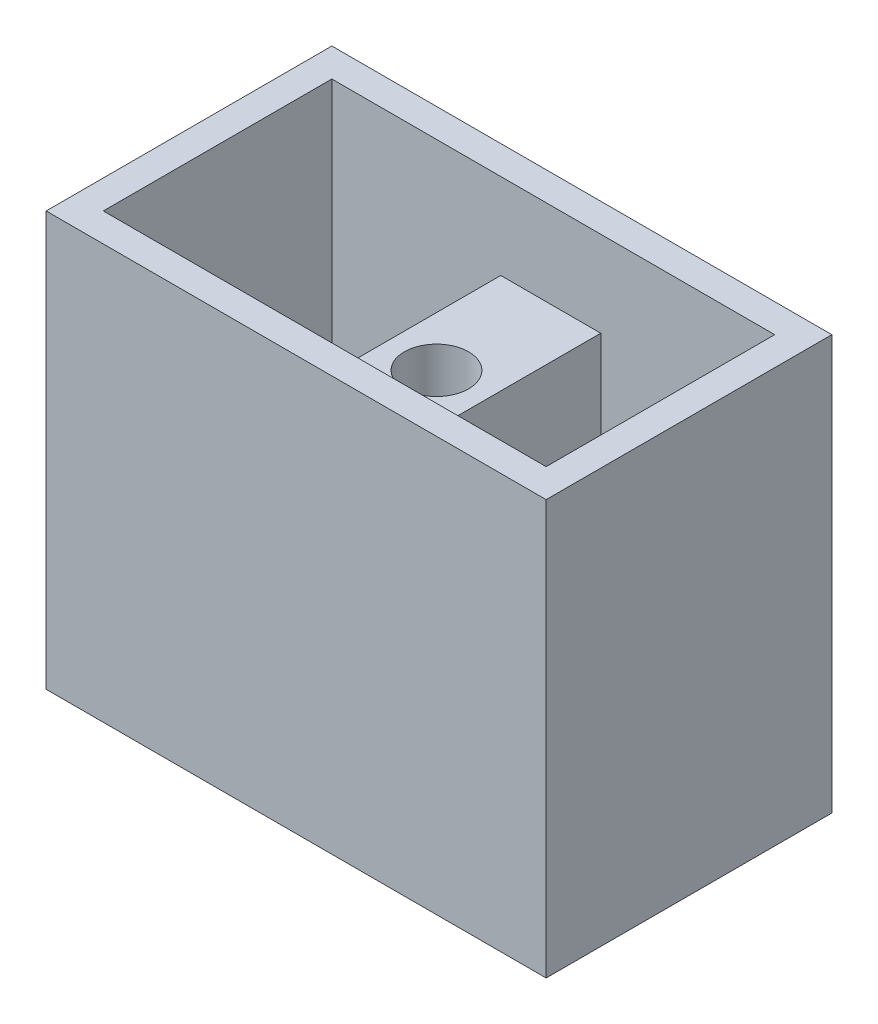
ISO-10303-21;
HEADER;
FILE_DESCRIPTION(('STEP AP214'),'2;1');
FILE_NAME('part.step','',(''),(''),'','','');
FILE_SCHEMA(('AUTOMOTIVE_DESIGN { 1 0 10303 214 1 1 1 1 }'));
ENDSEC;
DATA;
#1=APPLICATION_CONTEXT('core data for automotive mechanical design processes');
#2=APPLICATION_PROTOCOL_DEFINITION('international standard','automotive_design',2000,#1);
#3=PRODUCT_CONTEXT('',#1,'mechanical');
#4=PRODUCT('Part','Part','',(#3));
#5=PRODUCT_RELATED_PRODUCT_CATEGORY('part','',(#4));
#6=PRODUCT_DEFINITION_FORMATION('','',#4);
#7=PRODUCT_DEFINITION_CONTEXT('part definition',#1,'design');
#8=PRODUCT_DEFINITION('design','',#6,#7);
#9=PRODUCT_DEFINITION_SHAPE('','',#8);
#10=(LENGTH_UNIT() NAMED_UNIT(*) SI_UNIT(.MILLI.,.METRE.));
#11=(NAMED_UNIT(*) PLANE_ANGLE_UNIT() SI_UNIT($,.RADIAN.));
#12=(NAMED_UNIT(*) SI_UNIT($,.STERADIAN.) SOLID_ANGLE_UNIT());
#13=UNCERTAINTY_MEASURE_WITH_UNIT(LENGTH_MEASURE(1.E-05),#10,'distance_accuracy_value','');
#14=(GEOMETRIC_REPRESENTATION_CONTEXT(3) GLOBAL_UNCERTAINTY_ASSIGNED_CONTEXT((#13)) GLOBAL_UNIT_ASSIGNED_CONTEXT((#10,
#11,#12)) REPRESENTATION_CONTEXT('',''));
#15=CARTESIAN_POINT('',(0.,0.,0.));
#16=DIRECTION('',(0.,0.,1.));
#17=DIRECTION('',(1.,0.,0.));
#18=AXIS2_PLACEMENT_3D('',#15,#16,#17);
#19=CARTESIAN_POINT('',(69.1132816727556,0.,-90.));
#20=DIRECTION('',(1.,0.,0.));
#21=DIRECTION('',(0.,0.,-1.));
#22=AXIS2_PLACEMENT_3D('',#19,#20,#21);
#23=PLANE('',#22);
#24=DIRECTION('',(0.,0.,-1.));
#25=VECTOR('',#24,1.);
#26=CARTESIAN_POINT('',(69.1132816727556,30.,-10.));
#27=LINE('',#26,#25);
#28=CARTESIAN_POINT('',(69.1132816727556,30.,-10.));
#29=VERTEX_POINT('',#28);
#30=CARTESIAN_POINT('',(69.1132816727556,30.,-90.));
#31=VERTEX_POINT('',#30);
#32=EDGE_CURVE('E132',#29,#31,#27,.T.);
#33=ORIENTED_EDGE('',*,*,#32,.F.);
#34=DIRECTION('',(0.,1.,0.));
#35=VECTOR('',#34,1.);
#36=CARTESIAN_POINT('',(69.1132816727556,0.,-10.));
#37=LINE('',#36,#35);
#38=CARTESIAN_POINT('',(69.1132816727556,115.,-10.));
#39=VERTEX_POINT('',#38);
#40=EDGE_CURVE('E143',#29,#39,#37,.T.);
#41=ORIENTED_EDGE('',*,*,#40,.T.);
#42=DIRECTION('',(0.,0.,1.));
#43=VECTOR('',#42,1.);
#44=CARTESIAN_POINT('',(69.1132816727556,115.,-90.));
#45=LINE('',#44,#43);
#46=CARTESIAN_POINT('',(69.1132816727556,115.,-90.));
#47=VERTEX_POINT('',#46);
#48=EDGE_CURVE('E141',#47,#39,#45,.T.);
#49=ORIENTED_EDGE('',*,*,#48,.F.);
#50=DIRECTION('',(0.,1.,0.));
#51=VECTOR('',#50,1.);
#52=CARTESIAN_POINT('',(69.1132816727556,0.,-90.));
#53=LINE('',#52,#51);
#54=EDGE_CURVE('E126',#31,#47,#53,.T.);
#55=ORIENTED_EDGE('',*,*,#54,.F.);
#56=EDGE_LOOP('',(#33,#41,#49,#55));
#57=FACE_BOUND('',#56,.T.);
#58=ADVANCED_FACE('F32',(#57),#23,.F.);
#59=CARTESIAN_POINT('',(86.6132816727556,0.,-50.));
#60=DIRECTION('',(0.,1.,0.));
#61=DIRECTION('',(0.,0.,1.));
#62=AXIS2_PLACEMENT_3D('',#59,#60,#61);
#63=CYLINDRICAL_SURFACE('',#62,11.25);
#64=CARTESIAN_POINT('',(86.6132816727556,115.,-50.));
#65=DIRECTION('',(0.,1.,0.));
#66=DIRECTION('',(0.,0.,1.));
#67=AXIS2_PLACEMENT_3D('',#64,#65,#66);
#68=CIRCLE('',#67,11.25);
#69=CARTESIAN_POINT('',(86.6132816727556,115.,-38.75));
#70=VERTEX_POINT('',#69);
#71=EDGE_CURVE('E364',#70,#70,#68,.F.);
#72=ORIENTED_EDGE('',*,*,#71,.F.);
#73=EDGE_LOOP('',(#72));
#74=FACE_BOUND('',#73,.T.);
#75=CARTESIAN_POINT('',(86.6132816727556,30.,-50.));
#76=DIRECTION('',(0.,-1.,0.));
#77=DIRECTION('',(0.,0.,-1.));
#78=AXIS2_PLACEMENT_3D('',#75,#76,#77);
#79=CIRCLE('',#78,11.25);
#80=CARTESIAN_POINT('',(86.6132816727556,30.,-61.25));
#81=VERTEX_POINT('',#80);
#82=EDGE_CURVE('E352',#81,#81,#79,.F.);
#83=ORIENTED_EDGE('',*,*,#82,.F.);
#84=EDGE_LOOP('',(#83));
#85=FACE_BOUND('',#84,.T.);
#86=ADVANCED_FACE('F208',(#74,#85),#63,.F.);
#87=CARTESIAN_POINT('',(104.113281672756,0.,-90.));
#88=DIRECTION('',(-1.,0.,0.));
#89=DIRECTION('',(0.,0.,1.));
#90=AXIS2_PLACEMENT_3D('',#87,#88,#89);
#91=PLANE('',#90);
#92=DIRECTION('',(0.,0.,1.));
#93=VECTOR('',#92,1.);
#94=CARTESIAN_POINT('',(104.113281672756,30.,-10.));
#95=LINE('',#94,#93);
#96=CARTESIAN_POINT('',(104.113281672756,30.,-90.));
#97=VERTEX_POINT('',#96);
#98=CARTESIAN_POINT('',(104.113281672756,30.,-10.));
#99=VERTEX_POINT('',#98);
#100=EDGE_CURVE('E131',#97,#99,#95,.T.);
#101=ORIENTED_EDGE('',*,*,#100,.F.);
#102=DIRECTION('',(0.,1.,0.));
#103=VECTOR('',#102,1.);
#104=CARTESIAN_POINT('',(104.113281672756,0.,-90.));
#105=LINE('',#104,#103);
#106=CARTESIAN_POINT('',(104.113281672756,115.,-90.));
#107=VERTEX_POINT('',#106);
#108=EDGE_CURVE('E128',#97,#107,#105,.T.);
#109=ORIENTED_EDGE('',*,*,#108,.T.);
#110=DIRECTION('',(0.,0.,-1.));
#111=VECTOR('',#110,1.);
#112=CARTESIAN_POINT('',(104.113281672756,115.,-90.));
#113=LINE('',#112,#111);
#114=CARTESIAN_POINT('',(104.113281672756,115.,-10.));
#115=VERTEX_POINT('',#114);
#116=EDGE_CURVE('E360',#115,#107,#113,.T.);
#117=ORIENTED_EDGE('',*,*,#116,.F.);
#118=DIRECTION('',(0.,1.,0.));
#119=VECTOR('',#118,1.);
#120=CARTESIAN_POINT('',(104.113281672756,0.,-10.));
#121=LINE('',#120,#119);
#122=EDGE_CURVE('E52',#99,#115,#121,.T.);
#123=ORIENTED_EDGE('',*,*,#122,.F.);
#124=EDGE_LOOP('',(#101,#109,#117,#123));
#125=FACE_BOUND('',#124,.T.);
#126=ADVANCED_FACE('F206',(#125),#91,.F.);
#127=CARTESIAN_POINT('',(0.,145.,0.));
#128=DIRECTION('',(1.,0.,0.));
#129=DIRECTION('',(0.,0.,-1.));
#130=AXIS2_PLACEMENT_3D('',#127,#128,#129);
#131=PLANE('',#130);
#132=DIRECTION('',(0.,0.,1.));
#133=VECTOR('',#132,1.);
#134=CARTESIAN_POINT('',(0.,0.,0.));
#135=LINE('',#134,#133);
#136=CARTESIAN_POINT('',(0.,0.,-100.));
#137=VERTEX_POINT('',#136);
#138=CARTESIAN_POINT('',(0.,0.,0.));
#139=VERTEX_POINT('',#138);
#140=EDGE_CURVE('E142',#137,#139,#135,.T.);
#141=ORIENTED_EDGE('',*,*,#140,.T.);
#142=DIRECTION('',(0.,-1.,0.));
#143=VECTOR('',#142,1.);
#144=CARTESIAN_POINT('',(0.,145.,0.));
#145=LINE('',#144,#143);
#146=CARTESIAN_POINT('',(0.,145.,0.));
#147=VERTEX_POINT('',#146);
#148=EDGE_CURVE('E11',#147,#139,#145,.T.);
#149=ORIENTED_EDGE('',*,*,#148,.F.);
#150=DIRECTION('',(0.,0.,1.));
#151=VECTOR('',#150,1.);
#152=CARTESIAN_POINT('',(0.,145.,0.));
#153=LINE('',#152,#151);
#154=CARTESIAN_POINT('',(0.,145.,-100.));
#155=VERTEX_POINT('',#154);
#156=EDGE_CURVE('E159',#155,#147,#153,.T.);
#157=ORIENTED_EDGE('',*,*,#156,.F.);
#158=DIRECTION('',(0.,-1.,0.));
#159=VECTOR('',#158,1.);
#160=CARTESIAN_POINT('',(0.,145.,-100.));
#161=LINE('',#160,#159);
#162=EDGE_CURVE('E168',#155,#137,#161,.T.);
#163=ORIENTED_EDGE('',*,*,#162,.T.);
#164=EDGE_LOOP('',(#141,#149,#157,#163));
#165=FACE_BOUND('',#164,.T.);
#166=ADVANCED_FACE('F34',(#165),#131,.F.);
#167=CARTESIAN_POINT('',(0.,145.,0.));
#168=DIRECTION('',(0.,0.,-1.));
#169=DIRECTION('',(-1.,0.,0.));
#170=AXIS2_PLACEMENT_3D('',#167,#168,#169);
#171=PLANE('',#170);
#172=DIRECTION('',(1.,0.,0.));
#173=VECTOR('',#172,1.);
#174=CARTESIAN_POINT('',(0.,0.,0.));
#175=LINE('',#174,#173);
#176=CARTESIAN_POINT('',(175.,0.,0.));
#177=VERTEX_POINT('',#176);
#178=EDGE_CURVE('E146',#139,#177,#175,.T.);
#179=ORIENTED_EDGE('',*,*,#178,.T.);
#180=DIRECTION('',(0.,-1.,0.));
#181=VECTOR('',#180,1.);
#182=CARTESIAN_POINT('',(175.,145.,0.));
#183=LINE('',#182,#181);
#184=CARTESIAN_POINT('',(175.,145.,0.));
#185=VERTEX_POINT('',#184);
#186=EDGE_CURVE('E40',#185,#177,#183,.T.);
#187=ORIENTED_EDGE('',*,*,#186,.F.);
#188=DIRECTION('',(1.,0.,0.));
#189=VECTOR('',#188,1.);
#190=CARTESIAN_POINT('',(0.,145.,0.));
#191=LINE('',#190,#189);
#192=EDGE_CURVE('E162',#147,#185,#191,.T.);
#193=ORIENTED_EDGE('',*,*,#192,.F.);
#194=ORIENTED_EDGE('',*,*,#148,.T.);
#195=EDGE_LOOP('',(#179,#187,#193,#194));
#196=FACE_BOUND('',#195,.T.);
#197=ADVANCED_FACE('F199',(#196),#171,.F.);
#198=CARTESIAN_POINT('',(175.,145.,0.));
#199=DIRECTION('',(-1.,0.,0.));
#200=DIRECTION('',(0.,0.,1.));
#201=AXIS2_PLACEMENT_3D('',#198,#199,#200);
#202=PLANE('',#201);
#203=DIRECTION('',(0.,0.,-1.));
#204=VECTOR('',#203,1.);
#205=CARTESIAN_POINT('',(175.,0.,0.));
#206=LINE('',#205,#204);
#207=CARTESIAN_POINT('',(175.,0.,-100.));
#208=VERTEX_POINT('',#207);
#209=EDGE_CURVE('E171',#177,#208,#206,.T.);
#210=ORIENTED_EDGE('',*,*,#209,.T.);
#211=DIRECTION('',(0.,-1.,0.));
#212=VECTOR('',#211,1.);
#213=CARTESIAN_POINT('',(175.,145.,-100.));
#214=LINE('',#213,#212);
#215=CARTESIAN_POINT('',(175.,145.,-100.));
#216=VERTEX_POINT('',#215);
#217=EDGE_CURVE('E176',#216,#208,#214,.T.);
#218=ORIENTED_EDGE('',*,*,#217,.F.);
#219=DIRECTION('',(0.,0.,-1.));
#220=VECTOR('',#219,1.);
#221=CARTESIAN_POINT('',(175.,145.,0.));
#222=LINE('',#221,#220);
#223=EDGE_CURVE('E165',#185,#216,#222,.T.);
#224=ORIENTED_EDGE('',*,*,#223,.F.);
#225=ORIENTED_EDGE('',*,*,#186,.T.);
#226=EDGE_LOOP('',(#210,#218,#224,#225));
#227=FACE_BOUND('',#226,.T.);
#228=ADVANCED_FACE('F183',(#227),#202,.F.);
#229=CARTESIAN_POINT('',(0.,145.,-100.));
#230=DIRECTION('',(0.,0.,1.));
#231=DIRECTION('',(1.,0.,0.));
#232=AXIS2_PLACEMENT_3D('',#229,#230,#231);
#233=PLANE('',#232);
#234=DIRECTION('',(-1.,0.,0.));
#235=VECTOR('',#234,1.);
#236=CARTESIAN_POINT('',(0.,0.,-100.));
#237=LINE('',#236,#235);
#238=EDGE_CURVE('E163',#208,#137,#237,.T.);
#239=ORIENTED_EDGE('',*,*,#238,.T.);
#240=ORIENTED_EDGE('',*,*,#162,.F.);
#241=DIRECTION('',(-1.,0.,0.));
#242=VECTOR('',#241,1.);
#243=CARTESIAN_POINT('',(0.,145.,-100.));
#244=LINE('',#243,#242);
#245=EDGE_CURVE('E167',#216,#155,#244,.T.);
#246=ORIENTED_EDGE('',*,*,#245,.F.);
#247=ORIENTED_EDGE('',*,*,#217,.T.);
#248=EDGE_LOOP('',(#239,#240,#246,#247));
#249=FACE_BOUND('',#248,.T.);
#250=ADVANCED_FACE('F192',(#249),#233,.F.);
#251=CARTESIAN_POINT('',(0.,145.,0.));
#252=DIRECTION('',(0.,-1.,0.));
#253=DIRECTION('',(0.,0.,-1.));
#254=AXIS2_PLACEMENT_3D('',#251,#252,#253);
#255=PLANE('',#254);
#256=DIRECTION('',(-1.,0.,0.));
#257=VECTOR('',#256,1.);
#258=CARTESIAN_POINT('',(69.1132816727556,145.,-90.));
#259=LINE('',#258,#257);
#260=CARTESIAN_POINT('',(165.,145.,-90.));
#261=VERTEX_POINT('',#260);
#262=CARTESIAN_POINT('',(10.,145.,-90.));
#263=VERTEX_POINT('',#262);
#264=EDGE_CURVE('E376',#261,#263,#259,.T.);
#265=ORIENTED_EDGE('',*,*,#264,.F.);
#266=DIRECTION('',(0.,0.,-1.));
#267=VECTOR('',#266,1.);
#268=CARTESIAN_POINT('',(165.,145.,-10.));
#269=LINE('',#268,#267);
#270=CARTESIAN_POINT('',(165.,145.,-10.));
#271=VERTEX_POINT('',#270);
#272=EDGE_CURVE('E367',#271,#261,#269,.T.);
#273=ORIENTED_EDGE('',*,*,#272,.F.);
#274=DIRECTION('',(1.,0.,0.));
#275=VECTOR('',#274,1.);
#276=CARTESIAN_POINT('',(10.,145.,-10.));
#277=LINE('',#276,#275);
#278=CARTESIAN_POINT('',(10.,145.,-10.));
#279=VERTEX_POINT('',#278);
#280=EDGE_CURVE('E151',#279,#271,#277,.T.);
#281=ORIENTED_EDGE('',*,*,#280,.F.);
#282=DIRECTION('',(0.,0.,1.));
#283=VECTOR('',#282,1.);
#284=CARTESIAN_POINT('',(10.,145.,-90.));
#285=LINE('',#284,#283);
#286=EDGE_CURVE('E389',#263,#279,#285,.T.);
#287=ORIENTED_EDGE('',*,*,#286,.F.);
#288=EDGE_LOOP('',(#265,#273,#281,#287));
#289=FACE_BOUND('',#288,.T.);
#290=ORIENTED_EDGE('',*,*,#156,.T.);
#291=ORIENTED_EDGE('',*,*,#192,.T.);
#292=ORIENTED_EDGE('',*,*,#223,.T.);
#293=ORIENTED_EDGE('',*,*,#245,.T.);
#294=EDGE_LOOP('',(#290,#291,#292,#293));
#295=FACE_BOUND('',#294,.T.);
#296=ADVANCED_FACE('F198',(#289,#295),#255,.F.);
#297=CARTESIAN_POINT('',(0.,0.,0.));
#298=DIRECTION('',(0.,-1.,0.));
#299=DIRECTION('',(0.,0.,-1.));
#300=AXIS2_PLACEMENT_3D('',#297,#298,#299);
#301=PLANE('',#300);
#302=DIRECTION('',(1.,0.,0.));
#303=VECTOR('',#302,1.);
#304=CARTESIAN_POINT('',(10.,0.,-10.));
#305=LINE('',#304,#303);
#306=CARTESIAN_POINT('',(10.,0.,-10.));
#307=VERTEX_POINT('',#306);
#308=CARTESIAN_POINT('',(165.,0.,-10.));
#309=VERTEX_POINT('',#308);
#310=EDGE_CURVE('E158',#307,#309,#305,.T.);
#311=ORIENTED_EDGE('',*,*,#310,.T.);
#312=DIRECTION('',(0.,0.,-1.));
#313=VECTOR('',#312,1.);
#314=CARTESIAN_POINT('',(165.,0.,-10.));
#315=LINE('',#314,#313);
#316=CARTESIAN_POINT('',(165.,0.,-90.));
#317=VERTEX_POINT('',#316);
#318=EDGE_CURVE('E368',#309,#317,#315,.T.);
#319=ORIENTED_EDGE('',*,*,#318,.T.);
#320=DIRECTION('',(-1.,0.,0.));
#321=VECTOR('',#320,1.);
#322=CARTESIAN_POINT('',(69.1132816727556,0.,-90.));
#323=LINE('',#322,#321);
#324=CARTESIAN_POINT('',(10.,0.,-90.));
#325=VERTEX_POINT('',#324);
#326=EDGE_CURVE('E382',#317,#325,#323,.T.);
#327=ORIENTED_EDGE('',*,*,#326,.T.);
#328=DIRECTION('',(0.,0.,1.));
#329=VECTOR('',#328,1.);
#330=CARTESIAN_POINT('',(10.,0.,-90.));
#331=LINE('',#330,#329);
#332=EDGE_CURVE('E385',#325,#307,#331,.T.);
#333=ORIENTED_EDGE('',*,*,#332,.T.);
#334=EDGE_LOOP('',(#311,#319,#327,#333));
#335=FACE_BOUND('',#334,.T.);
#336=ORIENTED_EDGE('',*,*,#140,.F.);
#337=ORIENTED_EDGE('',*,*,#238,.F.);
#338=ORIENTED_EDGE('',*,*,#209,.F.);
#339=ORIENTED_EDGE('',*,*,#178,.F.);
#340=EDGE_LOOP('',(#336,#337,#338,#339));
#341=FACE_BOUND('',#340,.T.);
#342=ADVANCED_FACE('F189',(#335,#341),#301,.T.);
#343=CARTESIAN_POINT('',(69.1132816727556,0.,-90.));
#344=DIRECTION('',(0.,0.,-1.));
#345=DIRECTION('',(-1.,0.,0.));
#346=AXIS2_PLACEMENT_3D('',#343,#344,#345);
#347=PLANE('',#346);
#348=DIRECTION('',(1.,0.,0.));
#349=VECTOR('',#348,1.);
#350=CARTESIAN_POINT('',(69.1132816727556,30.,-90.));
#351=LINE('',#350,#349);
#352=EDGE_CURVE('E120',#31,#97,#351,.T.);
#353=ORIENTED_EDGE('',*,*,#352,.F.);
#354=ORIENTED_EDGE('',*,*,#54,.T.);
#355=DIRECTION('',(-1.,0.,0.));
#356=VECTOR('',#355,1.);
#357=CARTESIAN_POINT('',(69.1132816727556,115.,-90.));
#358=LINE('',#357,#356);
#359=EDGE_CURVE('E362',#107,#47,#358,.T.);
#360=ORIENTED_EDGE('',*,*,#359,.F.);
#361=ORIENTED_EDGE('',*,*,#108,.F.);
#362=EDGE_LOOP('',(#353,#354,#360,#361));
#363=FACE_BOUND('',#362,.T.);
#364=ORIENTED_EDGE('',*,*,#264,.T.);
#365=DIRECTION('',(0.,1.,0.));
#366=VECTOR('',#365,1.);
#367=CARTESIAN_POINT('',(10.,0.,-90.));
#368=LINE('',#367,#366);
#369=EDGE_CURVE('E155',#325,#263,#368,.T.);
#370=ORIENTED_EDGE('',*,*,#369,.F.);
#371=ORIENTED_EDGE('',*,*,#326,.F.);
#372=DIRECTION('',(0.,1.,0.));
#373=VECTOR('',#372,1.);
#374=CARTESIAN_POINT('',(165.,0.,-90.));
#375=LINE('',#374,#373);
#376=EDGE_CURVE('E373',#317,#261,#375,.T.);
#377=ORIENTED_EDGE('',*,*,#376,.T.);
#378=EDGE_LOOP('',(#364,#370,#371,#377));
#379=FACE_BOUND('',#378,.T.);
#380=ADVANCED_FACE('F122',(#363,#379),#347,.F.);
#381=CARTESIAN_POINT('',(10.,0.,-10.));
#382=DIRECTION('',(0.,0.,1.));
#383=DIRECTION('',(1.,0.,0.));
#384=AXIS2_PLACEMENT_3D('',#381,#382,#383);
#385=PLANE('',#384);
#386=ORIENTED_EDGE('',*,*,#40,.F.);
#387=DIRECTION('',(-1.,0.,0.));
#388=VECTOR('',#387,1.);
#389=CARTESIAN_POINT('',(69.1132816727556,30.,-10.));
#390=LINE('',#389,#388);
#391=EDGE_CURVE('E47',#99,#29,#390,.T.);
#392=ORIENTED_EDGE('',*,*,#391,.F.);
#393=ORIENTED_EDGE('',*,*,#122,.T.);
#394=DIRECTION('',(1.,0.,0.));
#395=VECTOR('',#394,1.);
#396=CARTESIAN_POINT('',(69.1132816727556,115.,-10.));
#397=LINE('',#396,#395);
#398=EDGE_CURVE('E358',#39,#115,#397,.T.);
#399=ORIENTED_EDGE('',*,*,#398,.F.);
#400=EDGE_LOOP('',(#386,#392,#393,#399));
#401=FACE_BOUND('',#400,.T.);
#402=ORIENTED_EDGE('',*,*,#280,.T.);
#403=DIRECTION('',(0.,1.,0.));
#404=VECTOR('',#403,1.);
#405=CARTESIAN_POINT('',(165.,0.,-10.));
#406=LINE('',#405,#404);
#407=EDGE_CURVE('E377',#309,#271,#406,.T.);
#408=ORIENTED_EDGE('',*,*,#407,.F.);
#409=ORIENTED_EDGE('',*,*,#310,.F.);
#410=DIRECTION('',(0.,1.,0.));
#411=VECTOR('',#410,1.);
#412=CARTESIAN_POINT('',(10.,0.,-10.));
#413=LINE('',#412,#411);
#414=EDGE_CURVE('E148',#307,#279,#413,.T.);
#415=ORIENTED_EDGE('',*,*,#414,.T.);
#416=EDGE_LOOP('',(#402,#408,#409,#415));
#417=FACE_BOUND('',#416,.T.);
#418=ADVANCED_FACE('F217',(#401,#417),#385,.F.);
#419=CARTESIAN_POINT('',(10.,0.,-90.));
#420=DIRECTION('',(-1.,0.,0.));
#421=DIRECTION('',(0.,0.,1.));
#422=AXIS2_PLACEMENT_3D('',#419,#420,#421);
#423=PLANE('',#422);
#424=ORIENTED_EDGE('',*,*,#286,.T.);
#425=ORIENTED_EDGE('',*,*,#414,.F.);
#426=ORIENTED_EDGE('',*,*,#332,.F.);
#427=ORIENTED_EDGE('',*,*,#369,.T.);
#428=EDGE_LOOP('',(#424,#425,#426,#427));
#429=FACE_BOUND('',#428,.T.);
#430=ADVANCED_FACE('F220',(#429),#423,.F.);
#431=CARTESIAN_POINT('',(165.,0.,-10.));
#432=DIRECTION('',(1.,0.,0.));
#433=DIRECTION('',(0.,0.,-1.));
#434=AXIS2_PLACEMENT_3D('',#431,#432,#433);
#435=PLANE('',#434);
#436=ORIENTED_EDGE('',*,*,#272,.T.);
#437=ORIENTED_EDGE('',*,*,#376,.F.);
#438=ORIENTED_EDGE('',*,*,#318,.F.);
#439=ORIENTED_EDGE('',*,*,#407,.T.);
#440=EDGE_LOOP('',(#436,#437,#438,#439));
#441=FACE_BOUND('',#440,.T.);
#442=ADVANCED_FACE('F223',(#441),#435,.F.);
#443=CARTESIAN_POINT('',(0.,115.,0.));
#444=DIRECTION('',(0.,1.,0.));
#445=DIRECTION('',(0.,0.,1.));
#446=AXIS2_PLACEMENT_3D('',#443,#444,#445);
#447=PLANE('',#446);
#448=ORIENTED_EDGE('',*,*,#48,.T.);
#449=ORIENTED_EDGE('',*,*,#398,.T.);
#450=ORIENTED_EDGE('',*,*,#116,.T.);
#451=ORIENTED_EDGE('',*,*,#359,.T.);
#452=EDGE_LOOP('',(#448,#449,#450,#451));
#453=FACE_BOUND('',#452,.T.);
#454=ORIENTED_EDGE('',*,*,#71,.T.);
#455=EDGE_LOOP('',(#454));
#456=FACE_BOUND('',#455,.T.);
#457=ADVANCED_FACE('F267',(#453,#456),#447,.T.);
#458=CARTESIAN_POINT('',(0.,30.,0.));
#459=DIRECTION('',(0.,-1.,0.));
#460=DIRECTION('',(0.,0.,-1.));
#461=AXIS2_PLACEMENT_3D('',#458,#459,#460);
#462=PLANE('',#461);
#463=ORIENTED_EDGE('',*,*,#32,.T.);
#464=ORIENTED_EDGE('',*,*,#352,.T.);
#465=ORIENTED_EDGE('',*,*,#100,.T.);
#466=ORIENTED_EDGE('',*,*,#391,.T.);
#467=EDGE_LOOP('',(#463,#464,#465,#466));
#468=FACE_BOUND('',#467,.T.);
#469=ORIENTED_EDGE('',*,*,#82,.T.);
#470=EDGE_LOOP('',(#469));
#471=FACE_BOUND('',#470,.T.);
#472=ADVANCED_FACE('F135',(#468,#471),#462,.T.);
#473=CLOSED_SHELL('',(#58,#86,#126,#166,#197,#228,#250,#296,#342,#380,#418,#430,#442,#457,#472));
#474=MANIFOLD_SOLID_BREP('B2',#473);
#475=ADVANCED_BREP_SHAPE_REPRESENTATION('',(#18,#474),#14);
#476=SHAPE_DEFINITION_REPRESENTATION(#9,#475);
ENDSEC;
END-ISO-10303-21;
